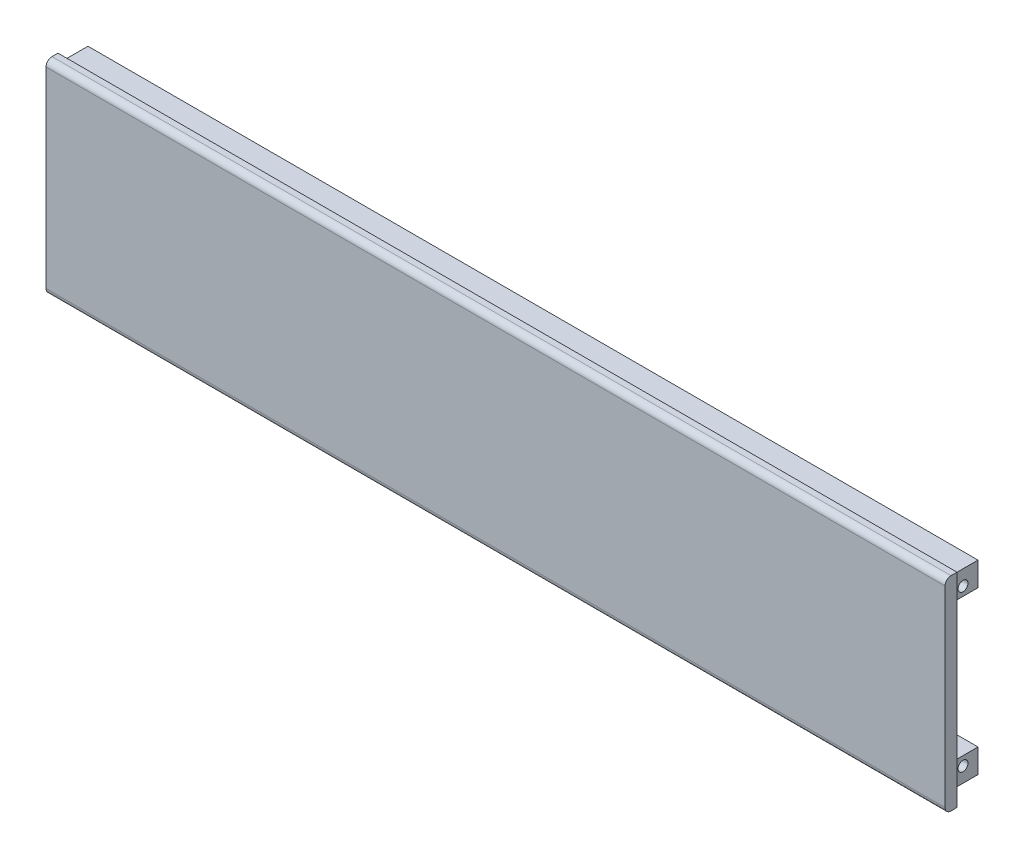
ISO-10303-21;
HEADER;
FILE_DESCRIPTION(('STEP AP214'),'2;1');
FILE_NAME('part.step','',(''),(''),'','','');
FILE_SCHEMA(('AUTOMOTIVE_DESIGN { 1 0 10303 214 1 1 1 1 }'));
ENDSEC;
DATA;
#1=APPLICATION_CONTEXT('core data for automotive mechanical design processes');
#2=APPLICATION_PROTOCOL_DEFINITION('international standard','automotive_design',2000,#1);
#3=PRODUCT_CONTEXT('',#1,'mechanical');
#4=PRODUCT('Part','Part','',(#3));
#5=PRODUCT_RELATED_PRODUCT_CATEGORY('part','',(#4));
#6=PRODUCT_DEFINITION_FORMATION('','',#4);
#7=PRODUCT_DEFINITION_CONTEXT('part definition',#1,'design');
#8=PRODUCT_DEFINITION('design','',#6,#7);
#9=PRODUCT_DEFINITION_SHAPE('','',#8);
#10=(LENGTH_UNIT() NAMED_UNIT(*) SI_UNIT(.MILLI.,.METRE.));
#11=(NAMED_UNIT(*) PLANE_ANGLE_UNIT() SI_UNIT($,.RADIAN.));
#12=(NAMED_UNIT(*) SI_UNIT($,.STERADIAN.) SOLID_ANGLE_UNIT());
#13=UNCERTAINTY_MEASURE_WITH_UNIT(LENGTH_MEASURE(1.E-05),#10,'distance_accuracy_value','');
#14=(GEOMETRIC_REPRESENTATION_CONTEXT(3) GLOBAL_UNCERTAINTY_ASSIGNED_CONTEXT((#13)) GLOBAL_UNIT_ASSIGNED_CONTEXT((#10,
#11,#12)) REPRESENTATION_CONTEXT('',''));
#15=CARTESIAN_POINT('',(0.,0.,0.));
#16=DIRECTION('',(0.,0.,1.));
#17=DIRECTION('',(1.,0.,0.));
#18=AXIS2_PLACEMENT_3D('',#15,#16,#17);
#19=CARTESIAN_POINT('',(300.,-34.,-2.));
#20=DIRECTION('',(0.,0.,1.));
#21=DIRECTION('',(1.,0.,0.));
#22=AXIS2_PLACEMENT_3D('',#19,#20,#21);
#23=PLANE('',#22);
#24=DIRECTION('',(1.,0.,0.));
#25=VECTOR('',#24,1.);
#26=CARTESIAN_POINT('',(300.,31.,-2.));
#27=LINE('',#26,#25);
#28=CARTESIAN_POINT('',(0.,31.,-2.));
#29=VERTEX_POINT('',#28);
#30=CARTESIAN_POINT('',(297.,31.,-2.));
#31=VERTEX_POINT('',#30);
#32=EDGE_CURVE('E177',#29,#31,#27,.T.);
#33=ORIENTED_EDGE('',*,*,#32,.F.);
#34=DIRECTION('',(0.,1.,0.));
#35=VECTOR('',#34,1.);
#36=CARTESIAN_POINT('',(0.,-34.,-2.));
#37=LINE('',#36,#35);
#38=CARTESIAN_POINT('',(0.,34.,-2.));
#39=VERTEX_POINT('',#38);
#40=EDGE_CURVE('E202',#29,#39,#37,.T.);
#41=ORIENTED_EDGE('',*,*,#40,.T.);
#42=DIRECTION('',(-1.,0.,0.));
#43=VECTOR('',#42,1.);
#44=CARTESIAN_POINT('',(300.,34.,-2.));
#45=LINE('',#44,#43);
#46=CARTESIAN_POINT('',(300.,34.,-2.));
#47=VERTEX_POINT('',#46);
#48=EDGE_CURVE('E231',#47,#39,#45,.T.);
#49=ORIENTED_EDGE('',*,*,#48,.F.);
#50=DIRECTION('',(0.,1.,0.));
#51=VECTOR('',#50,1.);
#52=CARTESIAN_POINT('',(300.,-34.,-2.));
#53=LINE('',#52,#51);
#54=CARTESIAN_POINT('',(300.,-34.,-2.));
#55=VERTEX_POINT('',#54);
#56=EDGE_CURVE('E237',#55,#47,#53,.T.);
#57=ORIENTED_EDGE('',*,*,#56,.F.);
#58=DIRECTION('',(-1.,0.,0.));
#59=VECTOR('',#58,1.);
#60=CARTESIAN_POINT('',(300.,-34.,-2.));
#61=LINE('',#60,#59);
#62=CARTESIAN_POINT('',(0.,-34.,-2.));
#63=VERTEX_POINT('',#62);
#64=EDGE_CURVE('E234',#55,#63,#61,.T.);
#65=ORIENTED_EDGE('',*,*,#64,.T.);
#66=CARTESIAN_POINT('',(0.,-31.,-2.));
#67=VERTEX_POINT('',#66);
#68=EDGE_CURVE('E156',#63,#67,#37,.T.);
#69=ORIENTED_EDGE('',*,*,#68,.T.);
#70=DIRECTION('',(-1.,0.,0.));
#71=VECTOR('',#70,1.);
#72=CARTESIAN_POINT('',(300.,-31.,-2.));
#73=LINE('',#72,#71);
#74=CARTESIAN_POINT('',(297.,-31.,-2.));
#75=VERTEX_POINT('',#74);
#76=EDGE_CURVE('E148',#75,#67,#73,.T.);
#77=ORIENTED_EDGE('',*,*,#76,.F.);
#78=DIRECTION('',(0.,1.,0.));
#79=VECTOR('',#78,1.);
#80=CARTESIAN_POINT('',(297.,-31.,-2.));
#81=LINE('',#80,#79);
#82=CARTESIAN_POINT('',(297.,-23.,-2.));
#83=VERTEX_POINT('',#82);
#84=EDGE_CURVE('E133',#75,#83,#81,.T.);
#85=ORIENTED_EDGE('',*,*,#84,.T.);
#86=DIRECTION('',(1.,0.,0.));
#87=VECTOR('',#86,1.);
#88=CARTESIAN_POINT('',(300.,-23.,-2.));
#89=LINE('',#88,#87);
#90=CARTESIAN_POINT('',(0.,-23.,-2.));
#91=VERTEX_POINT('',#90);
#92=EDGE_CURVE('E158',#91,#83,#89,.T.);
#93=ORIENTED_EDGE('',*,*,#92,.F.);
#94=CARTESIAN_POINT('',(0.,23.,-2.));
#95=VERTEX_POINT('',#94);
#96=EDGE_CURVE('E199',#91,#95,#37,.T.);
#97=ORIENTED_EDGE('',*,*,#96,.T.);
#98=DIRECTION('',(-1.,0.,0.));
#99=VECTOR('',#98,1.);
#100=CARTESIAN_POINT('',(300.,23.,-2.));
#101=LINE('',#100,#99);
#102=CARTESIAN_POINT('',(297.,23.,-2.));
#103=VERTEX_POINT('',#102);
#104=EDGE_CURVE('E36',#103,#95,#101,.T.);
#105=ORIENTED_EDGE('',*,*,#104,.F.);
#106=EDGE_CURVE('E142',#103,#31,#81,.T.);
#107=ORIENTED_EDGE('',*,*,#106,.T.);
#108=EDGE_LOOP('',(#33,#41,#49,#57,#65,#69,#77,#85,#93,#97,#105,#107));
#109=FACE_BOUND('',#108,.T.);
#110=ADVANCED_FACE('F32',(#109),#23,.F.);
#111=CARTESIAN_POINT('',(300.,34.,2.));
#112=DIRECTION('',(0.,-1.,0.));
#113=DIRECTION('',(0.,0.,-1.));
#114=AXIS2_PLACEMENT_3D('',#111,#112,#113);
#115=PLANE('',#114);
#116=DIRECTION('',(0.,0.,1.));
#117=VECTOR('',#116,1.);
#118=CARTESIAN_POINT('',(0.,34.,2.));
#119=LINE('',#118,#117);
#120=CARTESIAN_POINT('',(0.,34.,0.));
#121=VERTEX_POINT('',#120);
#122=EDGE_CURVE('E208',#39,#121,#119,.T.);
#123=ORIENTED_EDGE('',*,*,#122,.T.);
#124=DIRECTION('',(-1.,0.,0.));
#125=VECTOR('',#124,1.);
#126=CARTESIAN_POINT('',(300.,34.,0.));
#127=LINE('',#126,#125);
#128=CARTESIAN_POINT('',(300.,34.,0.));
#129=VERTEX_POINT('',#128);
#130=EDGE_CURVE('E11',#121,#129,#127,.F.);
#131=ORIENTED_EDGE('',*,*,#130,.T.);
#132=DIRECTION('',(0.,0.,1.));
#133=VECTOR('',#132,1.);
#134=CARTESIAN_POINT('',(300.,34.,2.));
#135=LINE('',#134,#133);
#136=EDGE_CURVE('E262',#47,#129,#135,.T.);
#137=ORIENTED_EDGE('',*,*,#136,.F.);
#138=ORIENTED_EDGE('',*,*,#48,.T.);
#139=EDGE_LOOP('',(#123,#131,#137,#138));
#140=FACE_BOUND('',#139,.T.);
#141=ADVANCED_FACE('F247',(#140),#115,.F.);
#142=CARTESIAN_POINT('',(300.,-34.,2.));
#143=DIRECTION('',(0.,0.,-1.));
#144=DIRECTION('',(-1.,0.,0.));
#145=AXIS2_PLACEMENT_3D('',#142,#143,#144);
#146=PLANE('',#145);
#147=DIRECTION('',(0.,-1.,0.));
#148=VECTOR('',#147,1.);
#149=CARTESIAN_POINT('',(0.,-34.,2.));
#150=LINE('',#149,#148);
#151=CARTESIAN_POINT('',(0.,32.,2.));
#152=VERTEX_POINT('',#151);
#153=CARTESIAN_POINT('',(0.,-32.,2.));
#154=VERTEX_POINT('',#153);
#155=EDGE_CURVE('E238',#152,#154,#150,.T.);
#156=ORIENTED_EDGE('',*,*,#155,.T.);
#157=DIRECTION('',(-1.,0.,0.));
#158=VECTOR('',#157,1.);
#159=CARTESIAN_POINT('',(300.,-32.,2.));
#160=LINE('',#159,#158);
#161=CARTESIAN_POINT('',(300.,-32.,2.));
#162=VERTEX_POINT('',#161);
#163=EDGE_CURVE('E219',#154,#162,#160,.F.);
#164=ORIENTED_EDGE('',*,*,#163,.T.);
#165=DIRECTION('',(0.,-1.,0.));
#166=VECTOR('',#165,1.);
#167=CARTESIAN_POINT('',(300.,-34.,2.));
#168=LINE('',#167,#166);
#169=CARTESIAN_POINT('',(300.,32.,2.));
#170=VERTEX_POINT('',#169);
#171=EDGE_CURVE('E260',#170,#162,#168,.T.);
#172=ORIENTED_EDGE('',*,*,#171,.F.);
#173=DIRECTION('',(-1.,0.,0.));
#174=VECTOR('',#173,1.);
#175=CARTESIAN_POINT('',(300.,32.,2.));
#176=LINE('',#175,#174);
#177=EDGE_CURVE('E221',#170,#152,#176,.T.);
#178=ORIENTED_EDGE('',*,*,#177,.T.);
#179=EDGE_LOOP('',(#156,#164,#172,#178));
#180=FACE_BOUND('',#179,.T.);
#181=ADVANCED_FACE('F263',(#180),#146,.F.);
#182=CARTESIAN_POINT('',(300.,-34.,2.));
#183=DIRECTION('',(0.,1.,0.));
#184=DIRECTION('',(0.,0.,1.));
#185=AXIS2_PLACEMENT_3D('',#182,#183,#184);
#186=PLANE('',#185);
#187=DIRECTION('',(0.,0.,-1.));
#188=VECTOR('',#187,1.);
#189=CARTESIAN_POINT('',(300.,-34.,2.));
#190=LINE('',#189,#188);
#191=CARTESIAN_POINT('',(300.,-34.,0.));
#192=VERTEX_POINT('',#191);
#193=EDGE_CURVE('E206',#192,#55,#190,.T.);
#194=ORIENTED_EDGE('',*,*,#193,.F.);
#195=DIRECTION('',(-1.,0.,0.));
#196=VECTOR('',#195,1.);
#197=CARTESIAN_POINT('',(300.,-34.,0.));
#198=LINE('',#197,#196);
#199=CARTESIAN_POINT('',(0.,-34.,0.));
#200=VERTEX_POINT('',#199);
#201=EDGE_CURVE('E228',#192,#200,#198,.T.);
#202=ORIENTED_EDGE('',*,*,#201,.T.);
#203=DIRECTION('',(0.,0.,-1.));
#204=VECTOR('',#203,1.);
#205=CARTESIAN_POINT('',(0.,-34.,2.));
#206=LINE('',#205,#204);
#207=EDGE_CURVE('E236',#200,#63,#206,.T.);
#208=ORIENTED_EDGE('',*,*,#207,.T.);
#209=ORIENTED_EDGE('',*,*,#64,.F.);
#210=EDGE_LOOP('',(#194,#202,#208,#209));
#211=FACE_BOUND('',#210,.T.);
#212=ADVANCED_FACE('F335',(#211),#186,.F.);
#213=CARTESIAN_POINT('',(300.,0.,0.));
#214=DIRECTION('',(-1.,0.,0.));
#215=DIRECTION('',(0.,0.,1.));
#216=AXIS2_PLACEMENT_3D('',#213,#214,#215);
#217=PLANE('',#216);
#218=ORIENTED_EDGE('',*,*,#56,.T.);
#219=ORIENTED_EDGE('',*,*,#136,.T.);
#220=CARTESIAN_POINT('',(300.,32.,0.));
#221=DIRECTION('',(-1.,0.,0.));
#222=DIRECTION('',(0.,0.,1.));
#223=AXIS2_PLACEMENT_3D('',#220,#221,#222);
#224=CIRCLE('',#223,2.);
#225=EDGE_CURVE('E217',#129,#170,#224,.F.);
#226=ORIENTED_EDGE('',*,*,#225,.T.);
#227=ORIENTED_EDGE('',*,*,#171,.T.);
#228=CARTESIAN_POINT('',(300.,-32.,0.));
#229=DIRECTION('',(-1.,0.,0.));
#230=DIRECTION('',(0.,0.,1.));
#231=AXIS2_PLACEMENT_3D('',#228,#229,#230);
#232=CIRCLE('',#231,2.);
#233=EDGE_CURVE('E42',#162,#192,#232,.F.);
#234=ORIENTED_EDGE('',*,*,#233,.T.);
#235=ORIENTED_EDGE('',*,*,#193,.T.);
#236=EDGE_LOOP('',(#218,#219,#226,#227,#234,#235));
#237=FACE_BOUND('',#236,.T.);
#238=ADVANCED_FACE('F259',(#237),#217,.F.);
#239=CARTESIAN_POINT('',(0.,0.,0.));
#240=DIRECTION('',(-1.,0.,0.));
#241=DIRECTION('',(0.,0.,1.));
#242=AXIS2_PLACEMENT_3D('',#239,#240,#241);
#243=PLANE('',#242);
#244=CARTESIAN_POINT('',(0.,26.,-7.));
#245=DIRECTION('',(-1.,0.,0.));
#246=DIRECTION('',(0.,0.,1.));
#247=AXIS2_PLACEMENT_3D('',#244,#245,#246);
#248=CIRCLE('',#247,1.64999999999998);
#249=CARTESIAN_POINT('',(0.,26.,-5.35000000000002));
#250=VERTEX_POINT('',#249);
#251=EDGE_CURVE('E163',#250,#250,#248,.T.);
#252=ORIENTED_EDGE('',*,*,#251,.F.);
#253=EDGE_LOOP('',(#252));
#254=FACE_BOUND('',#253,.T.);
#255=CARTESIAN_POINT('',(0.,-26.,-7.));
#256=DIRECTION('',(-1.,0.,0.));
#257=DIRECTION('',(0.,0.,1.));
#258=AXIS2_PLACEMENT_3D('',#255,#256,#257);
#259=CIRCLE('',#258,1.64999999999998);
#260=CARTESIAN_POINT('',(0.,-26.,-5.35000000000002));
#261=VERTEX_POINT('',#260);
#262=EDGE_CURVE('E159',#261,#261,#259,.T.);
#263=ORIENTED_EDGE('',*,*,#262,.F.);
#264=EDGE_LOOP('',(#263));
#265=FACE_BOUND('',#264,.T.);
#266=ORIENTED_EDGE('',*,*,#207,.F.);
#267=CARTESIAN_POINT('',(0.,-32.,0.));
#268=DIRECTION('',(-1.,0.,0.));
#269=DIRECTION('',(0.,0.,1.));
#270=AXIS2_PLACEMENT_3D('',#267,#268,#269);
#271=CIRCLE('',#270,2.);
#272=EDGE_CURVE('E224',#200,#154,#271,.T.);
#273=ORIENTED_EDGE('',*,*,#272,.T.);
#274=ORIENTED_EDGE('',*,*,#155,.F.);
#275=CARTESIAN_POINT('',(0.,32.,0.));
#276=DIRECTION('',(-1.,0.,0.));
#277=DIRECTION('',(0.,0.,1.));
#278=AXIS2_PLACEMENT_3D('',#275,#276,#277);
#279=CIRCLE('',#278,2.);
#280=EDGE_CURVE('E226',#152,#121,#279,.T.);
#281=ORIENTED_EDGE('',*,*,#280,.T.);
#282=ORIENTED_EDGE('',*,*,#122,.F.);
#283=ORIENTED_EDGE('',*,*,#40,.F.);
#284=DIRECTION('',(0.,0.,1.));
#285=VECTOR('',#284,1.);
#286=CARTESIAN_POINT('',(0.,31.,-12.));
#287=LINE('',#286,#285);
#288=CARTESIAN_POINT('',(0.,31.,-12.));
#289=VERTEX_POINT('',#288);
#290=EDGE_CURVE('E181',#289,#29,#287,.T.);
#291=ORIENTED_EDGE('',*,*,#290,.F.);
#292=DIRECTION('',(0.,1.,0.));
#293=VECTOR('',#292,1.);
#294=CARTESIAN_POINT('',(0.,31.,-12.));
#295=LINE('',#294,#293);
#296=CARTESIAN_POINT('',(0.,23.,-12.));
#297=VERTEX_POINT('',#296);
#298=EDGE_CURVE('E176',#297,#289,#295,.T.);
#299=ORIENTED_EDGE('',*,*,#298,.F.);
#300=DIRECTION('',(0.,0.,1.));
#301=VECTOR('',#300,1.);
#302=CARTESIAN_POINT('',(0.,23.,-12.));
#303=LINE('',#302,#301);
#304=EDGE_CURVE('E196',#297,#95,#303,.T.);
#305=ORIENTED_EDGE('',*,*,#304,.T.);
#306=ORIENTED_EDGE('',*,*,#96,.F.);
#307=DIRECTION('',(0.,0.,1.));
#308=VECTOR('',#307,1.);
#309=CARTESIAN_POINT('',(0.,-23.,-12.));
#310=LINE('',#309,#308);
#311=CARTESIAN_POINT('',(0.,-23.,-12.));
#312=VERTEX_POINT('',#311);
#313=EDGE_CURVE('E169',#312,#91,#310,.T.);
#314=ORIENTED_EDGE('',*,*,#313,.F.);
#315=DIRECTION('',(0.,1.,0.));
#316=VECTOR('',#315,1.);
#317=CARTESIAN_POINT('',(0.,-23.,-12.));
#318=LINE('',#317,#316);
#319=CARTESIAN_POINT('',(0.,-31.,-12.));
#320=VERTEX_POINT('',#319);
#321=EDGE_CURVE('E285',#320,#312,#318,.T.);
#322=ORIENTED_EDGE('',*,*,#321,.F.);
#323=DIRECTION('',(0.,0.,1.));
#324=VECTOR('',#323,1.);
#325=CARTESIAN_POINT('',(0.,-31.,-12.));
#326=LINE('',#325,#324);
#327=EDGE_CURVE('E172',#320,#67,#326,.T.);
#328=ORIENTED_EDGE('',*,*,#327,.T.);
#329=ORIENTED_EDGE('',*,*,#68,.F.);
#330=EDGE_LOOP('',(#266,#273,#274,#281,#282,#283,#291,#299,#305,#306,#314,#322,#328,#329));
#331=FACE_BOUND('',#330,.T.);
#332=ADVANCED_FACE('F270',(#254,#265,#331),#243,.T.);
#333=CARTESIAN_POINT('',(300.,-32.,0.));
#334=DIRECTION('',(-1.,0.,0.));
#335=DIRECTION('',(0.,0.,1.));
#336=AXIS2_PLACEMENT_3D('',#333,#334,#335);
#337=CYLINDRICAL_SURFACE('',#336,2.);
#338=ORIENTED_EDGE('',*,*,#233,.F.);
#339=ORIENTED_EDGE('',*,*,#163,.F.);
#340=ORIENTED_EDGE('',*,*,#272,.F.);
#341=ORIENTED_EDGE('',*,*,#201,.F.);
#342=EDGE_LOOP('',(#338,#339,#340,#341));
#343=FACE_BOUND('',#342,.T.);
#344=ADVANCED_FACE('F322',(#343),#337,.T.);
#345=CARTESIAN_POINT('',(300.,32.,0.));
#346=DIRECTION('',(-1.,0.,0.));
#347=DIRECTION('',(0.,0.,1.));
#348=AXIS2_PLACEMENT_3D('',#345,#346,#347);
#349=CYLINDRICAL_SURFACE('',#348,2.);
#350=ORIENTED_EDGE('',*,*,#225,.F.);
#351=ORIENTED_EDGE('',*,*,#130,.F.);
#352=ORIENTED_EDGE('',*,*,#280,.F.);
#353=ORIENTED_EDGE('',*,*,#177,.F.);
#354=EDGE_LOOP('',(#350,#351,#352,#353));
#355=FACE_BOUND('',#354,.T.);
#356=ADVANCED_FACE('F34',(#355),#349,.T.);
#357=CARTESIAN_POINT('',(300.,23.,-12.));
#358=DIRECTION('',(0.,1.,0.));
#359=DIRECTION('',(-1.,0.,0.));
#360=AXIS2_PLACEMENT_3D('',#357,#358,#359);
#361=PLANE('',#360);
#362=DIRECTION('',(-1.,0.,0.));
#363=VECTOR('',#362,1.);
#364=CARTESIAN_POINT('',(300.,23.,-12.));
#365=LINE('',#364,#363);
#366=CARTESIAN_POINT('',(297.,23.,-12.));
#367=VERTEX_POINT('',#366);
#368=EDGE_CURVE('E174',#367,#297,#365,.T.);
#369=ORIENTED_EDGE('',*,*,#368,.F.);
#370=DIRECTION('',(0.,0.,1.));
#371=VECTOR('',#370,1.);
#372=CARTESIAN_POINT('',(297.,23.,-12.));
#373=LINE('',#372,#371);
#374=EDGE_CURVE('E50',#367,#103,#373,.T.);
#375=ORIENTED_EDGE('',*,*,#374,.T.);
#376=ORIENTED_EDGE('',*,*,#104,.T.);
#377=ORIENTED_EDGE('',*,*,#304,.F.);
#378=EDGE_LOOP('',(#369,#375,#376,#377));
#379=FACE_BOUND('',#378,.T.);
#380=ADVANCED_FACE('F280',(#379),#361,.F.);
#381=CARTESIAN_POINT('',(300.,31.,-12.));
#382=DIRECTION('',(0.,-1.,0.));
#383=DIRECTION('',(1.,0.,0.));
#384=AXIS2_PLACEMENT_3D('',#381,#382,#383);
#385=PLANE('',#384);
#386=ORIENTED_EDGE('',*,*,#32,.T.);
#387=DIRECTION('',(0.,0.,1.));
#388=VECTOR('',#387,1.);
#389=CARTESIAN_POINT('',(297.,31.,-2.));
#390=LINE('',#389,#388);
#391=CARTESIAN_POINT('',(297.,31.,-12.));
#392=VERTEX_POINT('',#391);
#393=EDGE_CURVE('E152',#392,#31,#390,.T.);
#394=ORIENTED_EDGE('',*,*,#393,.F.);
#395=DIRECTION('',(1.,0.,0.));
#396=VECTOR('',#395,1.);
#397=CARTESIAN_POINT('',(300.,31.,-12.));
#398=LINE('',#397,#396);
#399=EDGE_CURVE('E179',#289,#392,#398,.T.);
#400=ORIENTED_EDGE('',*,*,#399,.F.);
#401=ORIENTED_EDGE('',*,*,#290,.T.);
#402=EDGE_LOOP('',(#386,#394,#400,#401));
#403=FACE_BOUND('',#402,.T.);
#404=ADVANCED_FACE('F273',(#403),#385,.F.);
#405=CARTESIAN_POINT('',(0.,0.,-12.));
#406=DIRECTION('',(0.,0.,-1.));
#407=DIRECTION('',(-1.,0.,0.));
#408=AXIS2_PLACEMENT_3D('',#405,#406,#407);
#409=PLANE('',#408);
#410=DIRECTION('',(0.,1.,0.));
#411=VECTOR('',#410,1.);
#412=CARTESIAN_POINT('',(297.,-31.,-12.));
#413=LINE('',#412,#411);
#414=EDGE_CURVE('E151',#367,#392,#413,.T.);
#415=ORIENTED_EDGE('',*,*,#414,.F.);
#416=ORIENTED_EDGE('',*,*,#368,.T.);
#417=ORIENTED_EDGE('',*,*,#298,.T.);
#418=ORIENTED_EDGE('',*,*,#399,.T.);
#419=EDGE_LOOP('',(#415,#416,#417,#418));
#420=FACE_BOUND('',#419,.T.);
#421=ADVANCED_FACE('F277',(#420),#409,.T.);
#422=CARTESIAN_POINT('',(300.,-31.,-12.));
#423=DIRECTION('',(0.,1.,0.));
#424=DIRECTION('',(0.,0.,1.));
#425=AXIS2_PLACEMENT_3D('',#422,#423,#424);
#426=PLANE('',#425);
#427=DIRECTION('',(-1.,0.,0.));
#428=VECTOR('',#427,1.);
#429=CARTESIAN_POINT('',(300.,-31.,-12.));
#430=LINE('',#429,#428);
#431=CARTESIAN_POINT('',(297.,-31.,-12.));
#432=VERTEX_POINT('',#431);
#433=EDGE_CURVE('E150',#432,#320,#430,.T.);
#434=ORIENTED_EDGE('',*,*,#433,.F.);
#435=DIRECTION('',(0.,0.,1.));
#436=VECTOR('',#435,1.);
#437=CARTESIAN_POINT('',(297.,-31.,-2.));
#438=LINE('',#437,#436);
#439=EDGE_CURVE('E58',#432,#75,#438,.T.);
#440=ORIENTED_EDGE('',*,*,#439,.T.);
#441=ORIENTED_EDGE('',*,*,#76,.T.);
#442=ORIENTED_EDGE('',*,*,#327,.F.);
#443=EDGE_LOOP('',(#434,#440,#441,#442));
#444=FACE_BOUND('',#443,.T.);
#445=ADVANCED_FACE('F146',(#444),#426,.F.);
#446=CARTESIAN_POINT('',(300.,-23.,-12.));
#447=DIRECTION('',(0.,-1.,0.));
#448=DIRECTION('',(0.,0.,-1.));
#449=AXIS2_PLACEMENT_3D('',#446,#447,#448);
#450=PLANE('',#449);
#451=ORIENTED_EDGE('',*,*,#92,.T.);
#452=DIRECTION('',(0.,0.,-1.));
#453=VECTOR('',#452,1.);
#454=CARTESIAN_POINT('',(297.,-23.,-12.));
#455=LINE('',#454,#453);
#456=CARTESIAN_POINT('',(297.,-23.,-12.));
#457=VERTEX_POINT('',#456);
#458=EDGE_CURVE('E136',#83,#457,#455,.T.);
#459=ORIENTED_EDGE('',*,*,#458,.T.);
#460=DIRECTION('',(1.,0.,0.));
#461=VECTOR('',#460,1.);
#462=CARTESIAN_POINT('',(300.,-23.,-12.));
#463=LINE('',#462,#461);
#464=EDGE_CURVE('E166',#312,#457,#463,.T.);
#465=ORIENTED_EDGE('',*,*,#464,.F.);
#466=ORIENTED_EDGE('',*,*,#313,.T.);
#467=EDGE_LOOP('',(#451,#459,#465,#466));
#468=FACE_BOUND('',#467,.T.);
#469=ADVANCED_FACE('F288',(#468),#450,.F.);
#470=CARTESIAN_POINT('',(0.,0.,-12.));
#471=DIRECTION('',(0.,0.,-1.));
#472=DIRECTION('',(-1.,0.,0.));
#473=AXIS2_PLACEMENT_3D('',#470,#471,#472);
#474=PLANE('',#473);
#475=EDGE_CURVE('E299',#432,#457,#413,.T.);
#476=ORIENTED_EDGE('',*,*,#475,.F.);
#477=ORIENTED_EDGE('',*,*,#433,.T.);
#478=ORIENTED_EDGE('',*,*,#321,.T.);
#479=ORIENTED_EDGE('',*,*,#464,.T.);
#480=EDGE_LOOP('',(#476,#477,#478,#479));
#481=FACE_BOUND('',#480,.T.);
#482=ADVANCED_FACE('F354',(#481),#474,.T.);
#483=CARTESIAN_POINT('',(300.,-26.,-7.));
#484=DIRECTION('',(1.,0.,0.));
#485=DIRECTION('',(0.,0.,-1.));
#486=AXIS2_PLACEMENT_3D('',#483,#484,#485);
#487=CYLINDRICAL_SURFACE('',#486,1.64999999999998);
#488=CARTESIAN_POINT('',(297.,-26.,-7.));
#489=DIRECTION('',(-1.,0.,0.));
#490=DIRECTION('',(0.,-1.,0.));
#491=AXIS2_PLACEMENT_3D('',#488,#489,#490);
#492=CIRCLE('',#491,1.64999999999998);
#493=CARTESIAN_POINT('',(297.,-27.65,-7.));
#494=VERTEX_POINT('',#493);
#495=EDGE_CURVE('E296',#494,#494,#492,.F.);
#496=ORIENTED_EDGE('',*,*,#495,.T.);
#497=EDGE_LOOP('',(#496));
#498=FACE_BOUND('',#497,.T.);
#499=ORIENTED_EDGE('',*,*,#262,.T.);
#500=EDGE_LOOP('',(#499));
#501=FACE_BOUND('',#500,.T.);
#502=ADVANCED_FACE('F311',(#498,#501),#487,.F.);
#503=CARTESIAN_POINT('',(300.,26.,-7.));
#504=DIRECTION('',(1.,0.,0.));
#505=DIRECTION('',(0.,0.,-1.));
#506=AXIS2_PLACEMENT_3D('',#503,#504,#505);
#507=CYLINDRICAL_SURFACE('',#506,1.64999999999998);
#508=CARTESIAN_POINT('',(297.,26.,-7.));
#509=DIRECTION('',(-1.,0.,0.));
#510=DIRECTION('',(0.,-1.,0.));
#511=AXIS2_PLACEMENT_3D('',#508,#509,#510);
#512=CIRCLE('',#511,1.64999999999998);
#513=CARTESIAN_POINT('',(297.,24.35,-7.));
#514=VERTEX_POINT('',#513);
#515=EDGE_CURVE('E141',#514,#514,#512,.F.);
#516=ORIENTED_EDGE('',*,*,#515,.T.);
#517=EDGE_LOOP('',(#516));
#518=FACE_BOUND('',#517,.T.);
#519=ORIENTED_EDGE('',*,*,#251,.T.);
#520=EDGE_LOOP('',(#519));
#521=FACE_BOUND('',#520,.T.);
#522=ADVANCED_FACE('F303',(#518,#521),#507,.F.);
#523=CARTESIAN_POINT('',(297.,-31.,-2.));
#524=DIRECTION('',(-1.,0.,0.));
#525=DIRECTION('',(0.,-1.,0.));
#526=AXIS2_PLACEMENT_3D('',#523,#524,#525);
#527=PLANE('',#526);
#528=ORIENTED_EDGE('',*,*,#515,.F.);
#529=EDGE_LOOP('',(#528));
#530=FACE_BOUND('',#529,.T.);
#531=ORIENTED_EDGE('',*,*,#414,.T.);
#532=ORIENTED_EDGE('',*,*,#393,.T.);
#533=ORIENTED_EDGE('',*,*,#106,.F.);
#534=ORIENTED_EDGE('',*,*,#374,.F.);
#535=EDGE_LOOP('',(#531,#532,#533,#534));
#536=FACE_BOUND('',#535,.T.);
#537=ADVANCED_FACE('F301',(#530,#536),#527,.F.);
#538=ORIENTED_EDGE('',*,*,#495,.F.);
#539=EDGE_LOOP('',(#538));
#540=FACE_BOUND('',#539,.T.);
#541=ORIENTED_EDGE('',*,*,#84,.F.);
#542=ORIENTED_EDGE('',*,*,#439,.F.);
#543=ORIENTED_EDGE('',*,*,#475,.T.);
#544=ORIENTED_EDGE('',*,*,#458,.F.);
#545=EDGE_LOOP('',(#541,#542,#543,#544));
#546=FACE_BOUND('',#545,.T.);
#547=ADVANCED_FACE('F134',(#540,#546),#527,.F.);
#548=CLOSED_SHELL('',(#110,#141,#181,#212,#238,#332,#344,#356,#380,#404,#421,#445,#469,#482,
#502,#522,#537,#547));
#549=MANIFOLD_SOLID_BREP('B2',#548);
#550=ADVANCED_BREP_SHAPE_REPRESENTATION('',(#18,#549),#14);
#551=SHAPE_DEFINITION_REPRESENTATION(#9,#550);
ENDSEC;
END-ISO-10303-21;
